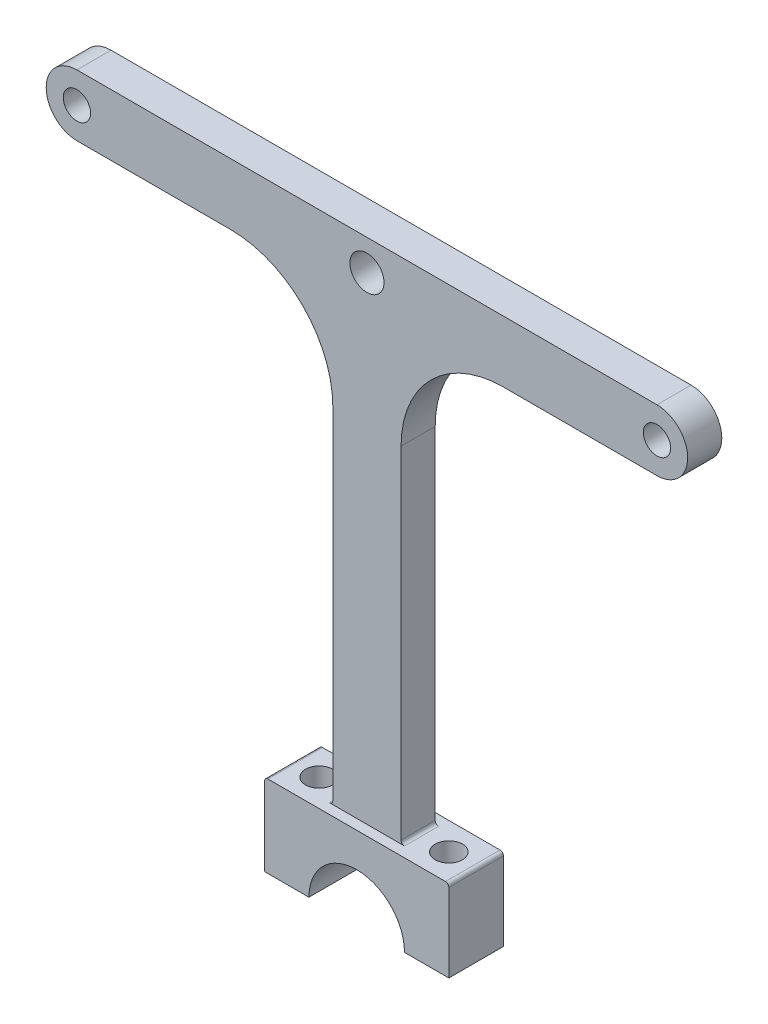
ISO-10303-21;
HEADER;
FILE_DESCRIPTION(('STEP AP214'),'2;1');
FILE_NAME('part.step','',(''),(''),'','','');
FILE_SCHEMA(('AUTOMOTIVE_DESIGN { 1 0 10303 214 1 1 1 1 }'));
ENDSEC;
DATA;
#1=APPLICATION_CONTEXT('core data for automotive mechanical design processes');
#2=APPLICATION_PROTOCOL_DEFINITION('international standard','automotive_design',2000,#1);
#3=PRODUCT_CONTEXT('',#1,'mechanical');
#4=PRODUCT('Part','Part','',(#3));
#5=PRODUCT_RELATED_PRODUCT_CATEGORY('part','',(#4));
#6=PRODUCT_DEFINITION_FORMATION('','',#4);
#7=PRODUCT_DEFINITION_CONTEXT('part definition',#1,'design');
#8=PRODUCT_DEFINITION('design','',#6,#7);
#9=PRODUCT_DEFINITION_SHAPE('','',#8);
#10=(LENGTH_UNIT() NAMED_UNIT(*) SI_UNIT(.MILLI.,.METRE.));
#11=(NAMED_UNIT(*) PLANE_ANGLE_UNIT() SI_UNIT($,.RADIAN.));
#12=(NAMED_UNIT(*) SI_UNIT($,.STERADIAN.) SOLID_ANGLE_UNIT());
#13=UNCERTAINTY_MEASURE_WITH_UNIT(LENGTH_MEASURE(1.E-05),#10,'distance_accuracy_value','');
#14=(GEOMETRIC_REPRESENTATION_CONTEXT(3) GLOBAL_UNCERTAINTY_ASSIGNED_CONTEXT((#13)) GLOBAL_UNIT_ASSIGNED_CONTEXT((#10,
#11,#12)) REPRESENTATION_CONTEXT('',''));
#15=CARTESIAN_POINT('',(0.,0.,0.));
#16=DIRECTION('',(0.,0.,1.));
#17=DIRECTION('',(1.,0.,0.));
#18=AXIS2_PLACEMENT_3D('',#15,#16,#17);
#19=CARTESIAN_POINT('',(20.,62.5,5.));
#20=DIRECTION('',(0.,0.,-1.));
#21=DIRECTION('',(-1.,0.,0.));
#22=AXIS2_PLACEMENT_3D('',#19,#20,#21);
#23=CYLINDRICAL_SURFACE('',#22,15.);
#24=CARTESIAN_POINT('',(20.,62.5,0.));
#25=DIRECTION('',(0.,0.,1.));
#26=DIRECTION('',(1.,0.,0.));
#27=AXIS2_PLACEMENT_3D('',#24,#25,#26);
#28=CIRCLE('',#27,15.);
#29=CARTESIAN_POINT('',(20.,77.5,0.));
#30=VERTEX_POINT('',#29);
#31=CARTESIAN_POINT('',(5.,62.5,0.));
#32=VERTEX_POINT('',#31);
#33=EDGE_CURVE('E307',#30,#32,#28,.T.);
#34=ORIENTED_EDGE('',*,*,#33,.F.);
#35=DIRECTION('',(0.,0.,-1.));
#36=VECTOR('',#35,1.);
#37=CARTESIAN_POINT('',(20.,77.5,5.));
#38=LINE('',#37,#36);
#39=CARTESIAN_POINT('',(20.,77.5,5.));
#40=VERTEX_POINT('',#39);
#41=EDGE_CURVE('E376',#40,#30,#38,.T.);
#42=ORIENTED_EDGE('',*,*,#41,.F.);
#43=CARTESIAN_POINT('',(20.,62.5,5.));
#44=DIRECTION('',(0.,0.,1.));
#45=DIRECTION('',(1.,0.,0.));
#46=AXIS2_PLACEMENT_3D('',#43,#44,#45);
#47=CIRCLE('',#46,15.);
#48=CARTESIAN_POINT('',(5.,62.5,5.));
#49=VERTEX_POINT('',#48);
#50=EDGE_CURVE('E263',#40,#49,#47,.T.);
#51=ORIENTED_EDGE('',*,*,#50,.T.);
#52=DIRECTION('',(0.,0.,-1.));
#53=VECTOR('',#52,1.);
#54=CARTESIAN_POINT('',(5.,62.5,5.));
#55=LINE('',#54,#53);
#56=EDGE_CURVE('E303',#49,#32,#55,.T.);
#57=ORIENTED_EDGE('',*,*,#56,.T.);
#58=EDGE_LOOP('',(#34,#42,#51,#57));
#59=FACE_BOUND('',#58,.T.);
#60=ADVANCED_FACE('F47',(#59),#23,.F.);
#61=CARTESIAN_POINT('',(0.,77.5,5.));
#62=DIRECTION('',(0.,1.,0.));
#63=DIRECTION('',(0.,0.,1.));
#64=AXIS2_PLACEMENT_3D('',#61,#62,#63);
#65=PLANE('',#64);
#66=DIRECTION('',(1.,0.,0.));
#67=VECTOR('',#66,1.);
#68=CARTESIAN_POINT('',(0.,77.5,0.));
#69=LINE('',#68,#67);
#70=CARTESIAN_POINT('',(42.5,77.5,0.));
#71=VERTEX_POINT('',#70);
#72=EDGE_CURVE('E311',#30,#71,#69,.T.);
#73=ORIENTED_EDGE('',*,*,#72,.T.);
#74=DIRECTION('',(0.,0.,-1.));
#75=VECTOR('',#74,1.);
#76=CARTESIAN_POINT('',(42.5,77.5,5.));
#77=LINE('',#76,#75);
#78=CARTESIAN_POINT('',(42.5,77.5,5.));
#79=VERTEX_POINT('',#78);
#80=EDGE_CURVE('E372',#79,#71,#77,.T.);
#81=ORIENTED_EDGE('',*,*,#80,.F.);
#82=DIRECTION('',(1.,0.,0.));
#83=VECTOR('',#82,1.);
#84=CARTESIAN_POINT('',(0.,77.5,5.));
#85=LINE('',#84,#83);
#86=EDGE_CURVE('E268',#40,#79,#85,.T.);
#87=ORIENTED_EDGE('',*,*,#86,.F.);
#88=ORIENTED_EDGE('',*,*,#41,.T.);
#89=EDGE_LOOP('',(#73,#81,#87,#88));
#90=FACE_BOUND('',#89,.T.);
#91=ADVANCED_FACE('F472',(#90),#65,.F.);
#92=CARTESIAN_POINT('',(42.5,82.,5.));
#93=DIRECTION('',(0.,0.,-1.));
#94=DIRECTION('',(-1.,0.,0.));
#95=AXIS2_PLACEMENT_3D('',#92,#93,#94);
#96=CYLINDRICAL_SURFACE('',#95,4.5);
#97=CARTESIAN_POINT('',(42.5,82.,0.));
#98=DIRECTION('',(0.,0.,1.));
#99=DIRECTION('',(1.,0.,0.));
#100=AXIS2_PLACEMENT_3D('',#97,#98,#99);
#101=CIRCLE('',#100,4.5);
#102=CARTESIAN_POINT('',(42.5,86.5,0.));
#103=VERTEX_POINT('',#102);
#104=EDGE_CURVE('E315',#71,#103,#101,.T.);
#105=ORIENTED_EDGE('',*,*,#104,.T.);
#106=DIRECTION('',(0.,0.,-1.));
#107=VECTOR('',#106,1.);
#108=CARTESIAN_POINT('',(42.5,86.5,5.));
#109=LINE('',#108,#107);
#110=CARTESIAN_POINT('',(42.5,86.5,5.));
#111=VERTEX_POINT('',#110);
#112=EDGE_CURVE('E369',#111,#103,#109,.T.);
#113=ORIENTED_EDGE('',*,*,#112,.F.);
#114=CARTESIAN_POINT('',(42.5,82.,5.));
#115=DIRECTION('',(0.,0.,1.));
#116=DIRECTION('',(1.,0.,0.));
#117=AXIS2_PLACEMENT_3D('',#114,#115,#116);
#118=CIRCLE('',#117,4.5);
#119=EDGE_CURVE('E272',#79,#111,#118,.T.);
#120=ORIENTED_EDGE('',*,*,#119,.F.);
#121=ORIENTED_EDGE('',*,*,#80,.T.);
#122=EDGE_LOOP('',(#105,#113,#120,#121));
#123=FACE_BOUND('',#122,.T.);
#124=ADVANCED_FACE('F469',(#123),#96,.T.);
#125=CARTESIAN_POINT('',(0.,86.5,5.));
#126=DIRECTION('',(0.,1.,0.));
#127=DIRECTION('',(0.,0.,1.));
#128=AXIS2_PLACEMENT_3D('',#125,#126,#127);
#129=PLANE('',#128);
#130=DIRECTION('',(1.,0.,0.));
#131=VECTOR('',#130,1.);
#132=CARTESIAN_POINT('',(0.,86.5,0.));
#133=LINE('',#132,#131);
#134=CARTESIAN_POINT('',(-42.5,86.5,0.));
#135=VERTEX_POINT('',#134);
#136=EDGE_CURVE('E320',#135,#103,#133,.T.);
#137=ORIENTED_EDGE('',*,*,#136,.F.);
#138=DIRECTION('',(0.,0.,-1.));
#139=VECTOR('',#138,1.);
#140=CARTESIAN_POINT('',(-42.5,86.5,5.));
#141=LINE('',#140,#139);
#142=CARTESIAN_POINT('',(-42.5,86.5,5.));
#143=VERTEX_POINT('',#142);
#144=EDGE_CURVE('E366',#143,#135,#141,.T.);
#145=ORIENTED_EDGE('',*,*,#144,.F.);
#146=DIRECTION('',(1.,0.,0.));
#147=VECTOR('',#146,1.);
#148=CARTESIAN_POINT('',(0.,86.5,5.));
#149=LINE('',#148,#147);
#150=EDGE_CURVE('E276',#143,#111,#149,.T.);
#151=ORIENTED_EDGE('',*,*,#150,.T.);
#152=ORIENTED_EDGE('',*,*,#112,.T.);
#153=EDGE_LOOP('',(#137,#145,#151,#152));
#154=FACE_BOUND('',#153,.T.);
#155=ADVANCED_FACE('F463',(#154),#129,.T.);
#156=CARTESIAN_POINT('',(-42.5,82.,5.));
#157=DIRECTION('',(0.,0.,-1.));
#158=DIRECTION('',(-1.,0.,0.));
#159=AXIS2_PLACEMENT_3D('',#156,#157,#158);
#160=CYLINDRICAL_SURFACE('',#159,4.5);
#161=CARTESIAN_POINT('',(-42.5,82.,0.));
#162=DIRECTION('',(0.,0.,1.));
#163=DIRECTION('',(1.,0.,0.));
#164=AXIS2_PLACEMENT_3D('',#161,#162,#163);
#165=CIRCLE('',#164,4.5);
#166=CARTESIAN_POINT('',(-42.5,77.5,0.));
#167=VERTEX_POINT('',#166);
#168=EDGE_CURVE('E324',#135,#167,#165,.T.);
#169=ORIENTED_EDGE('',*,*,#168,.T.);
#170=DIRECTION('',(0.,0.,-1.));
#171=VECTOR('',#170,1.);
#172=CARTESIAN_POINT('',(-42.5,77.5,5.));
#173=LINE('',#172,#171);
#174=CARTESIAN_POINT('',(-42.5,77.5,5.));
#175=VERTEX_POINT('',#174);
#176=EDGE_CURVE('E362',#175,#167,#173,.T.);
#177=ORIENTED_EDGE('',*,*,#176,.F.);
#178=CARTESIAN_POINT('',(-42.5,82.,5.));
#179=DIRECTION('',(0.,0.,1.));
#180=DIRECTION('',(1.,0.,0.));
#181=AXIS2_PLACEMENT_3D('',#178,#179,#180);
#182=CIRCLE('',#181,4.5);
#183=EDGE_CURVE('E280',#143,#175,#182,.T.);
#184=ORIENTED_EDGE('',*,*,#183,.F.);
#185=ORIENTED_EDGE('',*,*,#144,.T.);
#186=EDGE_LOOP('',(#169,#177,#184,#185));
#187=FACE_BOUND('',#186,.T.);
#188=ADVANCED_FACE('F460',(#187),#160,.T.);
#189=CARTESIAN_POINT('',(-20.,77.5,0.));
#190=VERTEX_POINT('',#189);
#191=EDGE_CURVE('E316',#167,#190,#69,.T.);
#192=ORIENTED_EDGE('',*,*,#191,.T.);
#193=DIRECTION('',(0.,0.,-1.));
#194=VECTOR('',#193,1.);
#195=CARTESIAN_POINT('',(-20.,77.5,5.));
#196=LINE('',#195,#194);
#197=CARTESIAN_POINT('',(-20.,77.5,5.));
#198=VERTEX_POINT('',#197);
#199=EDGE_CURVE('E359',#198,#190,#196,.T.);
#200=ORIENTED_EDGE('',*,*,#199,.F.);
#201=EDGE_CURVE('E273',#175,#198,#85,.T.);
#202=ORIENTED_EDGE('',*,*,#201,.F.);
#203=ORIENTED_EDGE('',*,*,#176,.T.);
#204=EDGE_LOOP('',(#192,#200,#202,#203));
#205=FACE_BOUND('',#204,.T.);
#206=ADVANCED_FACE('F457',(#205),#65,.F.);
#207=CARTESIAN_POINT('',(-20.,62.5,5.));
#208=DIRECTION('',(0.,0.,-1.));
#209=DIRECTION('',(-1.,0.,0.));
#210=AXIS2_PLACEMENT_3D('',#207,#208,#209);
#211=CYLINDRICAL_SURFACE('',#210,15.);
#212=CARTESIAN_POINT('',(-20.,62.5,0.));
#213=DIRECTION('',(0.,0.,1.));
#214=DIRECTION('',(1.,0.,0.));
#215=AXIS2_PLACEMENT_3D('',#212,#213,#214);
#216=CIRCLE('',#215,15.);
#217=CARTESIAN_POINT('',(-5.,62.5,0.));
#218=VERTEX_POINT('',#217);
#219=EDGE_CURVE('E328',#218,#190,#216,.T.);
#220=ORIENTED_EDGE('',*,*,#219,.F.);
#221=DIRECTION('',(0.,0.,-1.));
#222=VECTOR('',#221,1.);
#223=CARTESIAN_POINT('',(-5.,62.5,5.));
#224=LINE('',#223,#222);
#225=CARTESIAN_POINT('',(-5.,62.5,5.));
#226=VERTEX_POINT('',#225);
#227=EDGE_CURVE('E356',#226,#218,#224,.T.);
#228=ORIENTED_EDGE('',*,*,#227,.F.);
#229=CARTESIAN_POINT('',(-20.,62.5,5.));
#230=DIRECTION('',(0.,0.,1.));
#231=DIRECTION('',(1.,0.,0.));
#232=AXIS2_PLACEMENT_3D('',#229,#230,#231);
#233=CIRCLE('',#232,15.);
#234=EDGE_CURVE('E284',#226,#198,#233,.T.);
#235=ORIENTED_EDGE('',*,*,#234,.T.);
#236=ORIENTED_EDGE('',*,*,#199,.T.);
#237=EDGE_LOOP('',(#220,#228,#235,#236));
#238=FACE_BOUND('',#237,.T.);
#239=ADVANCED_FACE('F449',(#238),#211,.F.);
#240=CARTESIAN_POINT('',(-5.,0.,5.));
#241=DIRECTION('',(1.,0.,0.));
#242=DIRECTION('',(0.,0.,-1.));
#243=AXIS2_PLACEMENT_3D('',#240,#241,#242);
#244=PLANE('',#243);
#245=DIRECTION('',(0.,-1.,0.));
#246=VECTOR('',#245,1.);
#247=CARTESIAN_POINT('',(-5.,0.,0.));
#248=LINE('',#247,#246);
#249=CARTESIAN_POINT('',(-5.,12.5,0.));
#250=VERTEX_POINT('',#249);
#251=EDGE_CURVE('E332',#218,#250,#248,.T.);
#252=ORIENTED_EDGE('',*,*,#251,.T.);
#253=DIRECTION('',(0.,0.,-1.));
#254=VECTOR('',#253,1.);
#255=CARTESIAN_POINT('',(-5.,12.5,5.));
#256=LINE('',#255,#254);
#257=CARTESIAN_POINT('',(-5.,12.5,5.));
#258=VERTEX_POINT('',#257);
#259=EDGE_CURVE('E413',#250,#258,#256,.F.);
#260=ORIENTED_EDGE('',*,*,#259,.T.);
#261=DIRECTION('',(0.,-1.,0.));
#262=VECTOR('',#261,1.);
#263=CARTESIAN_POINT('',(-5.,0.,5.));
#264=LINE('',#263,#262);
#265=EDGE_CURVE('E288',#226,#258,#264,.T.);
#266=ORIENTED_EDGE('',*,*,#265,.F.);
#267=ORIENTED_EDGE('',*,*,#227,.T.);
#268=EDGE_LOOP('',(#252,#260,#266,#267));
#269=FACE_BOUND('',#268,.T.);
#270=ADVANCED_FACE('F445',(#269),#244,.F.);
#271=CARTESIAN_POINT('',(-13.5,0.,5.));
#272=DIRECTION('',(-1.,0.,0.));
#273=DIRECTION('',(0.,0.,1.));
#274=AXIS2_PLACEMENT_3D('',#271,#272,#273);
#275=PLANE('',#274);
#276=DIRECTION('',(0.,1.,0.));
#277=VECTOR('',#276,1.);
#278=CARTESIAN_POINT('',(-13.5,0.,6.5));
#279=LINE('',#278,#277);
#280=CARTESIAN_POINT('',(-13.5,0.,6.5));
#281=VERTEX_POINT('',#280);
#282=CARTESIAN_POINT('',(-13.5,11.5,6.5));
#283=VERTEX_POINT('',#282);
#284=EDGE_CURVE('E228',#281,#283,#279,.T.);
#285=ORIENTED_EDGE('',*,*,#284,.T.);
#286=DIRECTION('',(0.,0.,-1.));
#287=VECTOR('',#286,1.);
#288=CARTESIAN_POINT('',(-13.5,11.5,-1.5));
#289=LINE('',#288,#287);
#290=CARTESIAN_POINT('',(-13.5,11.5,-1.5));
#291=VERTEX_POINT('',#290);
#292=EDGE_CURVE('E382',#283,#291,#289,.T.);
#293=ORIENTED_EDGE('',*,*,#292,.T.);
#294=DIRECTION('',(0.,1.,0.));
#295=VECTOR('',#294,1.);
#296=CARTESIAN_POINT('',(-13.5,0.,-1.5));
#297=LINE('',#296,#295);
#298=CARTESIAN_POINT('',(-13.5,0.,-1.5));
#299=VERTEX_POINT('',#298);
#300=EDGE_CURVE('E247',#299,#291,#297,.T.);
#301=ORIENTED_EDGE('',*,*,#300,.F.);
#302=DIRECTION('',(0.,0.,-1.));
#303=VECTOR('',#302,1.);
#304=CARTESIAN_POINT('',(-13.5,0.,5.));
#305=LINE('',#304,#303);
#306=EDGE_CURVE('E353',#281,#299,#305,.T.);
#307=ORIENTED_EDGE('',*,*,#306,.F.);
#308=EDGE_LOOP('',(#285,#293,#301,#307));
#309=FACE_BOUND('',#308,.T.);
#310=ADVANCED_FACE('F537',(#309),#275,.T.);
#311=CARTESIAN_POINT('',(0.,0.,5.));
#312=DIRECTION('',(0.,-1.,0.));
#313=DIRECTION('',(1.,0.,0.));
#314=AXIS2_PLACEMENT_3D('',#311,#312,#313);
#315=PLANE('',#314);
#316=CARTESIAN_POINT('',(-9.5,0.,2.5));
#317=DIRECTION('',(0.,-1.,0.));
#318=DIRECTION('',(1.,0.,0.));
#319=AXIS2_PLACEMENT_3D('',#316,#317,#318);
#320=CIRCLE('',#319,2.);
#321=CARTESIAN_POINT('',(-7.5,0.,2.5));
#322=VERTEX_POINT('',#321);
#323=EDGE_CURVE('E219',#322,#322,#320,.T.);
#324=ORIENTED_EDGE('',*,*,#323,.F.);
#325=EDGE_LOOP('',(#324));
#326=FACE_BOUND('',#325,.T.);
#327=ORIENTED_EDGE('',*,*,#306,.T.);
#328=DIRECTION('',(-1.,0.,0.));
#329=VECTOR('',#328,1.);
#330=CARTESIAN_POINT('',(0.,0.,-1.5));
#331=LINE('',#330,#329);
#332=CARTESIAN_POINT('',(-7.,0.,-1.5));
#333=VERTEX_POINT('',#332);
#334=EDGE_CURVE('E251',#333,#299,#331,.T.);
#335=ORIENTED_EDGE('',*,*,#334,.F.);
#336=DIRECTION('',(0.,0.,-1.));
#337=VECTOR('',#336,1.);
#338=CARTESIAN_POINT('',(-7.,0.,5.));
#339=LINE('',#338,#337);
#340=CARTESIAN_POINT('',(-7.,0.,6.5));
#341=VERTEX_POINT('',#340);
#342=EDGE_CURVE('E197',#341,#333,#339,.T.);
#343=ORIENTED_EDGE('',*,*,#342,.F.);
#344=DIRECTION('',(-1.,0.,0.));
#345=VECTOR('',#344,1.);
#346=CARTESIAN_POINT('',(0.,0.,6.5));
#347=LINE('',#346,#345);
#348=EDGE_CURVE('E213',#341,#281,#347,.T.);
#349=ORIENTED_EDGE('',*,*,#348,.T.);
#350=EDGE_LOOP('',(#327,#335,#343,#349));
#351=FACE_BOUND('',#350,.T.);
#352=ADVANCED_FACE('F541',(#326,#351),#315,.T.);
#353=CARTESIAN_POINT('',(0.,0.,5.));
#354=DIRECTION('',(0.,0.,-1.));
#355=DIRECTION('',(-1.,0.,0.));
#356=AXIS2_PLACEMENT_3D('',#353,#354,#355);
#357=CYLINDRICAL_SURFACE('',#356,7.);
#358=ORIENTED_EDGE('',*,*,#342,.T.);
#359=CARTESIAN_POINT('',(0.,0.,-1.5));
#360=DIRECTION('',(0.,0.,1.));
#361=DIRECTION('',(1.,0.,0.));
#362=AXIS2_PLACEMENT_3D('',#359,#360,#361);
#363=CIRCLE('',#362,7.);
#364=CARTESIAN_POINT('',(7.,0.,-1.5));
#365=VERTEX_POINT('',#364);
#366=EDGE_CURVE('E192',#365,#333,#363,.T.);
#367=ORIENTED_EDGE('',*,*,#366,.F.);
#368=DIRECTION('',(0.,0.,-1.));
#369=VECTOR('',#368,1.);
#370=CARTESIAN_POINT('',(7.,0.,5.));
#371=LINE('',#370,#369);
#372=CARTESIAN_POINT('',(7.,0.,6.5));
#373=VERTEX_POINT('',#372);
#374=EDGE_CURVE('E185',#373,#365,#371,.T.);
#375=ORIENTED_EDGE('',*,*,#374,.F.);
#376=CARTESIAN_POINT('',(0.,0.,6.5));
#377=DIRECTION('',(0.,0.,1.));
#378=DIRECTION('',(1.,0.,0.));
#379=AXIS2_PLACEMENT_3D('',#376,#377,#378);
#380=CIRCLE('',#379,7.);
#381=EDGE_CURVE('E189',#373,#341,#380,.T.);
#382=ORIENTED_EDGE('',*,*,#381,.T.);
#383=EDGE_LOOP('',(#358,#367,#375,#382));
#384=FACE_BOUND('',#383,.T.);
#385=ADVANCED_FACE('F187',(#384),#357,.F.);
#386=CARTESIAN_POINT('',(0.,0.,5.));
#387=DIRECTION('',(0.,1.,0.));
#388=DIRECTION('',(0.,0.,1.));
#389=AXIS2_PLACEMENT_3D('',#386,#387,#388);
#390=PLANE('',#389);
#391=CARTESIAN_POINT('',(9.5,0.,2.5));
#392=DIRECTION('',(0.,1.,0.));
#393=DIRECTION('',(0.,0.,1.));
#394=AXIS2_PLACEMENT_3D('',#391,#392,#393);
#395=CIRCLE('',#394,2.);
#396=CARTESIAN_POINT('',(9.5,0.,4.5));
#397=VERTEX_POINT('',#396);
#398=EDGE_CURVE('E215',#397,#397,#395,.T.);
#399=ORIENTED_EDGE('',*,*,#398,.T.);
#400=EDGE_LOOP('',(#399));
#401=FACE_BOUND('',#400,.T.);
#402=ORIENTED_EDGE('',*,*,#374,.T.);
#403=DIRECTION('',(1.,0.,0.));
#404=VECTOR('',#403,1.);
#405=CARTESIAN_POINT('',(0.,0.,-1.5));
#406=LINE('',#405,#404);
#407=CARTESIAN_POINT('',(13.5,0.,-1.5));
#408=VERTEX_POINT('',#407);
#409=EDGE_CURVE('E236',#365,#408,#406,.T.);
#410=ORIENTED_EDGE('',*,*,#409,.T.);
#411=DIRECTION('',(0.,0.,-1.));
#412=VECTOR('',#411,1.);
#413=CARTESIAN_POINT('',(13.5,0.,5.));
#414=LINE('',#413,#412);
#415=CARTESIAN_POINT('',(13.5,0.,6.5));
#416=VERTEX_POINT('',#415);
#417=EDGE_CURVE('E198',#416,#408,#414,.T.);
#418=ORIENTED_EDGE('',*,*,#417,.F.);
#419=DIRECTION('',(1.,0.,0.));
#420=VECTOR('',#419,1.);
#421=CARTESIAN_POINT('',(0.,0.,6.5));
#422=LINE('',#421,#420);
#423=EDGE_CURVE('E201',#373,#416,#422,.T.);
#424=ORIENTED_EDGE('',*,*,#423,.F.);
#425=EDGE_LOOP('',(#402,#410,#418,#424));
#426=FACE_BOUND('',#425,.T.);
#427=ADVANCED_FACE('F202',(#401,#426),#390,.F.);
#428=CARTESIAN_POINT('',(13.5,0.,5.));
#429=DIRECTION('',(-1.,0.,0.));
#430=DIRECTION('',(0.,0.,1.));
#431=AXIS2_PLACEMENT_3D('',#428,#429,#430);
#432=PLANE('',#431);
#433=DIRECTION('',(0.,1.,0.));
#434=VECTOR('',#433,1.);
#435=CARTESIAN_POINT('',(13.5,0.,-1.5));
#436=LINE('',#435,#434);
#437=CARTESIAN_POINT('',(13.5,11.5,-1.5));
#438=VERTEX_POINT('',#437);
#439=EDGE_CURVE('E239',#408,#438,#436,.T.);
#440=ORIENTED_EDGE('',*,*,#439,.T.);
#441=DIRECTION('',(0.,0.,-1.));
#442=VECTOR('',#441,1.);
#443=CARTESIAN_POINT('',(13.5,11.5,5.));
#444=LINE('',#443,#442);
#445=CARTESIAN_POINT('',(13.5,11.5,6.5));
#446=VERTEX_POINT('',#445);
#447=EDGE_CURVE('E416',#438,#446,#444,.F.);
#448=ORIENTED_EDGE('',*,*,#447,.T.);
#449=DIRECTION('',(0.,1.,0.));
#450=VECTOR('',#449,1.);
#451=CARTESIAN_POINT('',(13.5,0.,6.5));
#452=LINE('',#451,#450);
#453=EDGE_CURVE('E207',#416,#446,#452,.T.);
#454=ORIENTED_EDGE('',*,*,#453,.F.);
#455=ORIENTED_EDGE('',*,*,#417,.T.);
#456=EDGE_LOOP('',(#440,#448,#454,#455));
#457=FACE_BOUND('',#456,.T.);
#458=ADVANCED_FACE('F544',(#457),#432,.F.);
#459=CARTESIAN_POINT('',(0.,12.,5.));
#460=DIRECTION('',(0.,-1.,0.));
#461=DIRECTION('',(1.,0.,0.));
#462=AXIS2_PLACEMENT_3D('',#459,#460,#461);
#463=PLANE('',#462);
#464=CARTESIAN_POINT('',(9.5,12.,2.5));
#465=DIRECTION('',(0.,1.,0.));
#466=DIRECTION('',(-1.,0.,0.));
#467=AXIS2_PLACEMENT_3D('',#464,#465,#466);
#468=CIRCLE('',#467,2.);
#469=CARTESIAN_POINT('',(7.5,12.,2.5));
#470=VERTEX_POINT('',#469);
#471=EDGE_CURVE('E860',#470,#470,#468,.T.);
#472=ORIENTED_EDGE('',*,*,#471,.F.);
#473=EDGE_LOOP('',(#472));
#474=FACE_BOUND('',#473,.T.);
#475=CARTESIAN_POINT('',(-9.5,12.,2.5));
#476=DIRECTION('',(0.,1.,0.));
#477=DIRECTION('',(-1.,0.,0.));
#478=AXIS2_PLACEMENT_3D('',#475,#476,#477);
#479=CIRCLE('',#478,2.);
#480=CARTESIAN_POINT('',(-11.5,12.,2.5));
#481=VERTEX_POINT('',#480);
#482=EDGE_CURVE('E863',#481,#481,#479,.T.);
#483=ORIENTED_EDGE('',*,*,#482,.F.);
#484=EDGE_LOOP('',(#483));
#485=FACE_BOUND('',#484,.T.);
#486=DIRECTION('',(0.,0.,-1.));
#487=VECTOR('',#486,1.);
#488=CARTESIAN_POINT('',(-5.5,12.,0.));
#489=LINE('',#488,#487);
#490=CARTESIAN_POINT('',(-5.5,12.,5.));
#491=VERTEX_POINT('',#490);
#492=CARTESIAN_POINT('',(-5.5,12.,0.));
#493=VERTEX_POINT('',#492);
#494=EDGE_CURVE('E400',#491,#493,#489,.T.);
#495=ORIENTED_EDGE('',*,*,#494,.T.);
#496=DIRECTION('',(-1.,0.,0.));
#497=VECTOR('',#496,1.);
#498=CARTESIAN_POINT('',(0.,12.,0.));
#499=LINE('',#498,#497);
#500=CARTESIAN_POINT('',(5.5,12.,0.));
#501=VERTEX_POINT('',#500);
#502=EDGE_CURVE('E379',#501,#493,#499,.T.);
#503=ORIENTED_EDGE('',*,*,#502,.F.);
#504=DIRECTION('',(0.,0.,-1.));
#505=VECTOR('',#504,1.);
#506=CARTESIAN_POINT('',(5.5,12.,5.));
#507=LINE('',#506,#505);
#508=CARTESIAN_POINT('',(5.5,12.,5.));
#509=VERTEX_POINT('',#508);
#510=EDGE_CURVE('E392',#501,#509,#507,.F.);
#511=ORIENTED_EDGE('',*,*,#510,.T.);
#512=DIRECTION('',(-1.,0.,0.));
#513=VECTOR('',#512,1.);
#514=CARTESIAN_POINT('',(0.,12.,5.));
#515=LINE('',#514,#513);
#516=EDGE_CURVE('E255',#509,#491,#515,.T.);
#517=ORIENTED_EDGE('',*,*,#516,.T.);
#518=EDGE_LOOP('',(#495,#503,#511,#517));
#519=FACE_BOUND('',#518,.T.);
#520=DIRECTION('',(-1.,0.,0.));
#521=VECTOR('',#520,1.);
#522=CARTESIAN_POINT('',(0.,12.,-1.5));
#523=LINE('',#522,#521);
#524=CARTESIAN_POINT('',(13.,12.,-1.5));
#525=VERTEX_POINT('',#524);
#526=CARTESIAN_POINT('',(-13.,12.,-1.5));
#527=VERTEX_POINT('',#526);
#528=EDGE_CURVE('E243',#525,#527,#523,.T.);
#529=ORIENTED_EDGE('',*,*,#528,.T.);
#530=DIRECTION('',(0.,0.,-1.));
#531=VECTOR('',#530,1.);
#532=CARTESIAN_POINT('',(-13.,12.,6.5));
#533=LINE('',#532,#531);
#534=CARTESIAN_POINT('',(-13.,12.,6.5));
#535=VERTEX_POINT('',#534);
#536=EDGE_CURVE('E404',#527,#535,#533,.F.);
#537=ORIENTED_EDGE('',*,*,#536,.T.);
#538=DIRECTION('',(-1.,0.,0.));
#539=VECTOR('',#538,1.);
#540=CARTESIAN_POINT('',(0.,12.,6.5));
#541=LINE('',#540,#539);
#542=CARTESIAN_POINT('',(13.,12.,6.5));
#543=VERTEX_POINT('',#542);
#544=EDGE_CURVE('E225',#543,#535,#541,.T.);
#545=ORIENTED_EDGE('',*,*,#544,.F.);
#546=DIRECTION('',(0.,0.,-1.));
#547=VECTOR('',#546,1.);
#548=CARTESIAN_POINT('',(13.,12.,5.));
#549=LINE('',#548,#547);
#550=EDGE_CURVE('E396',#543,#525,#549,.T.);
#551=ORIENTED_EDGE('',*,*,#550,.T.);
#552=EDGE_LOOP('',(#529,#537,#545,#551));
#553=FACE_BOUND('',#552,.T.);
#554=ADVANCED_FACE('F435',(#474,#485,#519,#553),#463,.F.);
#555=CARTESIAN_POINT('',(42.5,82.,5.));
#556=DIRECTION('',(0.,0.,-1.));
#557=DIRECTION('',(-1.,0.,0.));
#558=AXIS2_PLACEMENT_3D('',#555,#556,#557);
#559=CYLINDRICAL_SURFACE('',#558,2.);
#560=CARTESIAN_POINT('',(42.5,82.,5.));
#561=DIRECTION('',(0.,0.,1.));
#562=DIRECTION('',(1.,0.,0.));
#563=AXIS2_PLACEMENT_3D('',#560,#561,#562);
#564=CIRCLE('',#563,2.);
#565=CARTESIAN_POINT('',(44.5,82.,5.));
#566=VERTEX_POINT('',#565);
#567=EDGE_CURVE('E295',#566,#566,#564,.T.);
#568=ORIENTED_EDGE('',*,*,#567,.T.);
#569=EDGE_LOOP('',(#568));
#570=FACE_BOUND('',#569,.T.);
#571=CARTESIAN_POINT('',(42.5,82.,0.));
#572=DIRECTION('',(0.,0.,1.));
#573=DIRECTION('',(1.,0.,0.));
#574=AXIS2_PLACEMENT_3D('',#571,#572,#573);
#575=CIRCLE('',#574,2.);
#576=CARTESIAN_POINT('',(44.5,82.,0.));
#577=VERTEX_POINT('',#576);
#578=EDGE_CURVE('E340',#577,#577,#575,.T.);
#579=ORIENTED_EDGE('',*,*,#578,.F.);
#580=EDGE_LOOP('',(#579));
#581=FACE_BOUND('',#580,.T.);
#582=ADVANCED_FACE('F551',(#570,#581),#559,.F.);
#583=CARTESIAN_POINT('',(5.,0.,5.));
#584=DIRECTION('',(1.,0.,0.));
#585=DIRECTION('',(0.,0.,-1.));
#586=AXIS2_PLACEMENT_3D('',#583,#584,#585);
#587=PLANE('',#586);
#588=DIRECTION('',(0.,-1.,0.));
#589=VECTOR('',#588,1.);
#590=CARTESIAN_POINT('',(5.,0.,5.));
#591=LINE('',#590,#589);
#592=CARTESIAN_POINT('',(5.,12.5,5.));
#593=VERTEX_POINT('',#592);
#594=EDGE_CURVE('E292',#49,#593,#591,.T.);
#595=ORIENTED_EDGE('',*,*,#594,.T.);
#596=DIRECTION('',(0.,0.,-1.));
#597=VECTOR('',#596,1.);
#598=CARTESIAN_POINT('',(5.,12.5,5.));
#599=LINE('',#598,#597);
#600=CARTESIAN_POINT('',(5.,12.5,0.));
#601=VERTEX_POINT('',#600);
#602=EDGE_CURVE('E419',#593,#601,#599,.T.);
#603=ORIENTED_EDGE('',*,*,#602,.T.);
#604=DIRECTION('',(0.,-1.,0.));
#605=VECTOR('',#604,1.);
#606=CARTESIAN_POINT('',(5.,0.,0.));
#607=LINE('',#606,#605);
#608=EDGE_CURVE('E336',#32,#601,#607,.T.);
#609=ORIENTED_EDGE('',*,*,#608,.F.);
#610=ORIENTED_EDGE('',*,*,#56,.F.);
#611=EDGE_LOOP('',(#595,#603,#609,#610));
#612=FACE_BOUND('',#611,.T.);
#613=ADVANCED_FACE('F476',(#612),#587,.T.);
#614=CARTESIAN_POINT('',(0.,82.,5.));
#615=DIRECTION('',(0.,0.,-1.));
#616=DIRECTION('',(-1.,0.,0.));
#617=AXIS2_PLACEMENT_3D('',#614,#615,#616);
#618=CYLINDRICAL_SURFACE('',#617,2.5);
#619=CARTESIAN_POINT('',(0.,82.,5.));
#620=DIRECTION('',(0.,0.,1.));
#621=DIRECTION('',(1.,0.,0.));
#622=AXIS2_PLACEMENT_3D('',#619,#620,#621);
#623=CIRCLE('',#622,2.5);
#624=CARTESIAN_POINT('',(2.5,82.,5.));
#625=VERTEX_POINT('',#624);
#626=EDGE_CURVE('E259',#625,#625,#623,.T.);
#627=ORIENTED_EDGE('',*,*,#626,.T.);
#628=EDGE_LOOP('',(#627));
#629=FACE_BOUND('',#628,.T.);
#630=CARTESIAN_POINT('',(0.,82.,0.));
#631=DIRECTION('',(0.,0.,1.));
#632=DIRECTION('',(1.,0.,0.));
#633=AXIS2_PLACEMENT_3D('',#630,#631,#632);
#634=CIRCLE('',#633,2.5);
#635=CARTESIAN_POINT('',(2.5,82.,0.));
#636=VERTEX_POINT('',#635);
#637=EDGE_CURVE('E258',#636,#636,#634,.T.);
#638=ORIENTED_EDGE('',*,*,#637,.F.);
#639=EDGE_LOOP('',(#638));
#640=FACE_BOUND('',#639,.T.);
#641=ADVANCED_FACE('F491',(#629,#640),#618,.F.);
#642=CARTESIAN_POINT('',(-42.5,82.,5.));
#643=DIRECTION('',(0.,0.,-1.));
#644=DIRECTION('',(-1.,0.,0.));
#645=AXIS2_PLACEMENT_3D('',#642,#643,#644);
#646=CYLINDRICAL_SURFACE('',#645,2.);
#647=CARTESIAN_POINT('',(-42.5,82.,5.));
#648=DIRECTION('',(0.,0.,1.));
#649=DIRECTION('',(1.,0.,0.));
#650=AXIS2_PLACEMENT_3D('',#647,#648,#649);
#651=CIRCLE('',#650,2.);
#652=CARTESIAN_POINT('',(-40.5,82.,5.));
#653=VERTEX_POINT('',#652);
#654=EDGE_CURVE('E299',#653,#653,#651,.T.);
#655=ORIENTED_EDGE('',*,*,#654,.T.);
#656=EDGE_LOOP('',(#655));
#657=FACE_BOUND('',#656,.T.);
#658=CARTESIAN_POINT('',(-42.5,82.,0.));
#659=DIRECTION('',(0.,0.,1.));
#660=DIRECTION('',(1.,0.,0.));
#661=AXIS2_PLACEMENT_3D('',#658,#659,#660);
#662=CIRCLE('',#661,2.);
#663=CARTESIAN_POINT('',(-40.5,82.,0.));
#664=VERTEX_POINT('',#663);
#665=EDGE_CURVE('E264',#664,#664,#662,.T.);
#666=ORIENTED_EDGE('',*,*,#665,.F.);
#667=EDGE_LOOP('',(#666));
#668=FACE_BOUND('',#667,.T.);
#669=ADVANCED_FACE('F481',(#657,#668),#646,.F.);
#670=CARTESIAN_POINT('',(0.,0.,5.));
#671=DIRECTION('',(0.,0.,1.));
#672=DIRECTION('',(1.,0.,0.));
#673=AXIS2_PLACEMENT_3D('',#670,#671,#672);
#674=PLANE('',#673);
#675=ORIENTED_EDGE('',*,*,#516,.F.);
#676=CARTESIAN_POINT('',(5.5,12.5,5.));
#677=DIRECTION('',(0.,0.,1.));
#678=DIRECTION('',(1.,0.,0.));
#679=AXIS2_PLACEMENT_3D('',#676,#677,#678);
#680=CIRCLE('',#679,0.5);
#681=EDGE_CURVE('E11',#509,#593,#680,.F.);
#682=ORIENTED_EDGE('',*,*,#681,.T.);
#683=ORIENTED_EDGE('',*,*,#594,.F.);
#684=ORIENTED_EDGE('',*,*,#50,.F.);
#685=ORIENTED_EDGE('',*,*,#86,.T.);
#686=ORIENTED_EDGE('',*,*,#119,.T.);
#687=ORIENTED_EDGE('',*,*,#150,.F.);
#688=ORIENTED_EDGE('',*,*,#183,.T.);
#689=ORIENTED_EDGE('',*,*,#201,.T.);
#690=ORIENTED_EDGE('',*,*,#234,.F.);
#691=ORIENTED_EDGE('',*,*,#265,.T.);
#692=CARTESIAN_POINT('',(-5.5,12.5,5.));
#693=DIRECTION('',(0.,0.,1.));
#694=DIRECTION('',(1.,0.,0.));
#695=AXIS2_PLACEMENT_3D('',#692,#693,#694);
#696=CIRCLE('',#695,0.5);
#697=EDGE_CURVE('E425',#258,#491,#696,.F.);
#698=ORIENTED_EDGE('',*,*,#697,.T.);
#699=EDGE_LOOP('',(#675,#682,#683,#684,#685,#686,#687,#688,#689,#690,#691,#698));
#700=FACE_BOUND('',#699,.T.);
#701=ORIENTED_EDGE('',*,*,#626,.F.);
#702=EDGE_LOOP('',(#701));
#703=FACE_BOUND('',#702,.T.);
#704=ORIENTED_EDGE('',*,*,#567,.F.);
#705=EDGE_LOOP('',(#704));
#706=FACE_BOUND('',#705,.T.);
#707=ORIENTED_EDGE('',*,*,#654,.F.);
#708=EDGE_LOOP('',(#707));
#709=FACE_BOUND('',#708,.T.);
#710=ADVANCED_FACE('F477',(#700,#703,#706,#709),#674,.T.);
#711=CARTESIAN_POINT('',(0.,0.,0.));
#712=DIRECTION('',(0.,0.,1.));
#713=DIRECTION('',(1.,0.,0.));
#714=AXIS2_PLACEMENT_3D('',#711,#712,#713);
#715=PLANE('',#714);
#716=ORIENTED_EDGE('',*,*,#637,.T.);
#717=EDGE_LOOP('',(#716));
#718=FACE_BOUND('',#717,.T.);
#719=ORIENTED_EDGE('',*,*,#608,.T.);
#720=CARTESIAN_POINT('',(5.5,12.5,0.));
#721=DIRECTION('',(0.,0.,1.));
#722=DIRECTION('',(1.,0.,0.));
#723=AXIS2_PLACEMENT_3D('',#720,#721,#722);
#724=CIRCLE('',#723,0.5);
#725=EDGE_CURVE('E56',#601,#501,#724,.T.);
#726=ORIENTED_EDGE('',*,*,#725,.T.);
#727=ORIENTED_EDGE('',*,*,#502,.T.);
#728=CARTESIAN_POINT('',(-5.5,12.5,0.));
#729=DIRECTION('',(0.,0.,1.));
#730=DIRECTION('',(1.,0.,0.));
#731=AXIS2_PLACEMENT_3D('',#728,#729,#730);
#732=CIRCLE('',#731,0.5);
#733=EDGE_CURVE('E422',#493,#250,#732,.T.);
#734=ORIENTED_EDGE('',*,*,#733,.T.);
#735=ORIENTED_EDGE('',*,*,#251,.F.);
#736=ORIENTED_EDGE('',*,*,#219,.T.);
#737=ORIENTED_EDGE('',*,*,#191,.F.);
#738=ORIENTED_EDGE('',*,*,#168,.F.);
#739=ORIENTED_EDGE('',*,*,#136,.T.);
#740=ORIENTED_EDGE('',*,*,#104,.F.);
#741=ORIENTED_EDGE('',*,*,#72,.F.);
#742=ORIENTED_EDGE('',*,*,#33,.T.);
#743=EDGE_LOOP('',(#719,#726,#727,#734,#735,#736,#737,#738,#739,#740,#741,#742));
#744=FACE_BOUND('',#743,.T.);
#745=ORIENTED_EDGE('',*,*,#578,.T.);
#746=EDGE_LOOP('',(#745));
#747=FACE_BOUND('',#746,.T.);
#748=ORIENTED_EDGE('',*,*,#665,.T.);
#749=EDGE_LOOP('',(#748));
#750=FACE_BOUND('',#749,.T.);
#751=ADVANCED_FACE('F430',(#718,#744,#747,#750),#715,.F.);
#752=CARTESIAN_POINT('',(0.,0.,-1.5));
#753=DIRECTION('',(0.,0.,1.));
#754=DIRECTION('',(1.,0.,0.));
#755=AXIS2_PLACEMENT_3D('',#752,#753,#754);
#756=PLANE('',#755);
#757=ORIENTED_EDGE('',*,*,#300,.T.);
#758=CARTESIAN_POINT('',(-13.,11.5,-1.5));
#759=DIRECTION('',(0.,0.,1.));
#760=DIRECTION('',(1.,0.,0.));
#761=AXIS2_PLACEMENT_3D('',#758,#759,#760);
#762=CIRCLE('',#761,0.5);
#763=EDGE_CURVE('E389',#291,#527,#762,.F.);
#764=ORIENTED_EDGE('',*,*,#763,.T.);
#765=ORIENTED_EDGE('',*,*,#528,.F.);
#766=CARTESIAN_POINT('',(13.,11.5,-1.5));
#767=DIRECTION('',(0.,0.,1.));
#768=DIRECTION('',(1.,0.,0.));
#769=AXIS2_PLACEMENT_3D('',#766,#767,#768);
#770=CIRCLE('',#769,0.5);
#771=EDGE_CURVE('E386',#525,#438,#770,.F.);
#772=ORIENTED_EDGE('',*,*,#771,.T.);
#773=ORIENTED_EDGE('',*,*,#439,.F.);
#774=ORIENTED_EDGE('',*,*,#409,.F.);
#775=ORIENTED_EDGE('',*,*,#366,.T.);
#776=ORIENTED_EDGE('',*,*,#334,.T.);
#777=EDGE_LOOP('',(#757,#764,#765,#772,#773,#774,#775,#776));
#778=FACE_BOUND('',#777,.T.);
#779=ADVANCED_FACE('F496',(#778),#756,.F.);
#780=CARTESIAN_POINT('',(0.,0.,6.5));
#781=DIRECTION('',(0.,0.,1.));
#782=DIRECTION('',(1.,0.,0.));
#783=AXIS2_PLACEMENT_3D('',#780,#781,#782);
#784=PLANE('',#783);
#785=ORIENTED_EDGE('',*,*,#544,.T.);
#786=CARTESIAN_POINT('',(-13.,11.5,6.5));
#787=DIRECTION('',(0.,0.,1.));
#788=DIRECTION('',(1.,0.,0.));
#789=AXIS2_PLACEMENT_3D('',#786,#787,#788);
#790=CIRCLE('',#789,0.5);
#791=EDGE_CURVE('E410',#535,#283,#790,.T.);
#792=ORIENTED_EDGE('',*,*,#791,.T.);
#793=ORIENTED_EDGE('',*,*,#284,.F.);
#794=ORIENTED_EDGE('',*,*,#348,.F.);
#795=ORIENTED_EDGE('',*,*,#381,.F.);
#796=ORIENTED_EDGE('',*,*,#423,.T.);
#797=ORIENTED_EDGE('',*,*,#453,.T.);
#798=CARTESIAN_POINT('',(13.,11.5,6.5));
#799=DIRECTION('',(0.,0.,1.));
#800=DIRECTION('',(1.,0.,0.));
#801=AXIS2_PLACEMENT_3D('',#798,#799,#800);
#802=CIRCLE('',#801,0.5);
#803=EDGE_CURVE('E407',#446,#543,#802,.T.);
#804=ORIENTED_EDGE('',*,*,#803,.T.);
#805=EDGE_LOOP('',(#785,#792,#793,#794,#795,#796,#797,#804));
#806=FACE_BOUND('',#805,.T.);
#807=ADVANCED_FACE('F210',(#806),#784,.T.);
#808=CARTESIAN_POINT('',(-9.49999999999999,-88.,2.5));
#809=DIRECTION('',(0.,1.,0.));
#810=DIRECTION('',(-1.,0.,0.));
#811=AXIS2_PLACEMENT_3D('',#808,#809,#810);
#812=CYLINDRICAL_SURFACE('',#811,2.);
#813=ORIENTED_EDGE('',*,*,#323,.T.);
#814=EDGE_LOOP('',(#813));
#815=FACE_BOUND('',#814,.T.);
#816=ORIENTED_EDGE('',*,*,#482,.T.);
#817=EDGE_LOOP('',(#816));
#818=FACE_BOUND('',#817,.T.);
#819=ADVANCED_FACE('F699',(#815,#818),#812,.F.);
#820=CARTESIAN_POINT('',(9.50000000000001,-88.,2.5));
#821=DIRECTION('',(0.,1.,0.));
#822=DIRECTION('',(-1.,0.,0.));
#823=AXIS2_PLACEMENT_3D('',#820,#821,#822);
#824=CYLINDRICAL_SURFACE('',#823,2.);
#825=ORIENTED_EDGE('',*,*,#471,.T.);
#826=EDGE_LOOP('',(#825));
#827=FACE_BOUND('',#826,.T.);
#828=ORIENTED_EDGE('',*,*,#398,.F.);
#829=EDGE_LOOP('',(#828));
#830=FACE_BOUND('',#829,.T.);
#831=ADVANCED_FACE('F519',(#827,#830),#824,.F.);
#832=CARTESIAN_POINT('',(-13.,11.5,5.));
#833=DIRECTION('',(0.,0.,1.));
#834=DIRECTION('',(1.,0.,0.));
#835=AXIS2_PLACEMENT_3D('',#832,#833,#834);
#836=CYLINDRICAL_SURFACE('',#835,0.5);
#837=ORIENTED_EDGE('',*,*,#791,.F.);
#838=ORIENTED_EDGE('',*,*,#536,.F.);
#839=ORIENTED_EDGE('',*,*,#763,.F.);
#840=ORIENTED_EDGE('',*,*,#292,.F.);
#841=EDGE_LOOP('',(#837,#838,#839,#840));
#842=FACE_BOUND('',#841,.T.);
#843=ADVANCED_FACE('F516',(#842),#836,.T.);
#844=CARTESIAN_POINT('',(-5.5,12.5,5.));
#845=DIRECTION('',(0.,0.,1.));
#846=DIRECTION('',(1.,0.,0.));
#847=AXIS2_PLACEMENT_3D('',#844,#845,#846);
#848=CYLINDRICAL_SURFACE('',#847,0.5);
#849=ORIENTED_EDGE('',*,*,#697,.F.);
#850=ORIENTED_EDGE('',*,*,#259,.F.);
#851=ORIENTED_EDGE('',*,*,#733,.F.);
#852=ORIENTED_EDGE('',*,*,#494,.F.);
#853=EDGE_LOOP('',(#849,#850,#851,#852));
#854=FACE_BOUND('',#853,.T.);
#855=ADVANCED_FACE('F440',(#854),#848,.F.);
#856=CARTESIAN_POINT('',(13.,11.5,5.));
#857=DIRECTION('',(0.,0.,-1.));
#858=DIRECTION('',(-1.,0.,0.));
#859=AXIS2_PLACEMENT_3D('',#856,#857,#858);
#860=CYLINDRICAL_SURFACE('',#859,0.5);
#861=ORIENTED_EDGE('',*,*,#803,.F.);
#862=ORIENTED_EDGE('',*,*,#447,.F.);
#863=ORIENTED_EDGE('',*,*,#771,.F.);
#864=ORIENTED_EDGE('',*,*,#550,.F.);
#865=EDGE_LOOP('',(#861,#862,#863,#864));
#866=FACE_BOUND('',#865,.T.);
#867=ADVANCED_FACE('F522',(#866),#860,.T.);
#868=CARTESIAN_POINT('',(5.5,12.5,5.));
#869=DIRECTION('',(0.,0.,-1.));
#870=DIRECTION('',(-1.,0.,0.));
#871=AXIS2_PLACEMENT_3D('',#868,#869,#870);
#872=CYLINDRICAL_SURFACE('',#871,0.5);
#873=ORIENTED_EDGE('',*,*,#681,.F.);
#874=ORIENTED_EDGE('',*,*,#510,.F.);
#875=ORIENTED_EDGE('',*,*,#725,.F.);
#876=ORIENTED_EDGE('',*,*,#602,.F.);
#877=EDGE_LOOP('',(#873,#874,#875,#876));
#878=FACE_BOUND('',#877,.T.);
#879=ADVANCED_FACE('F49',(#878),#872,.F.);
#880=CLOSED_SHELL('',(#60,#91,#124,#155,#188,#206,#239,#270,#310,#352,#385,#427,#458,#554,#582,
#613,#641,#669,#710,#751,#779,#807,#819,#831,#843,#855,#867,#879));
#881=MANIFOLD_SOLID_BREP('B2',#880);
#882=ADVANCED_BREP_SHAPE_REPRESENTATION('',(#18,#881),#14);
#883=SHAPE_DEFINITION_REPRESENTATION(#9,#882);
ENDSEC;
END-ISO-10303-21;
